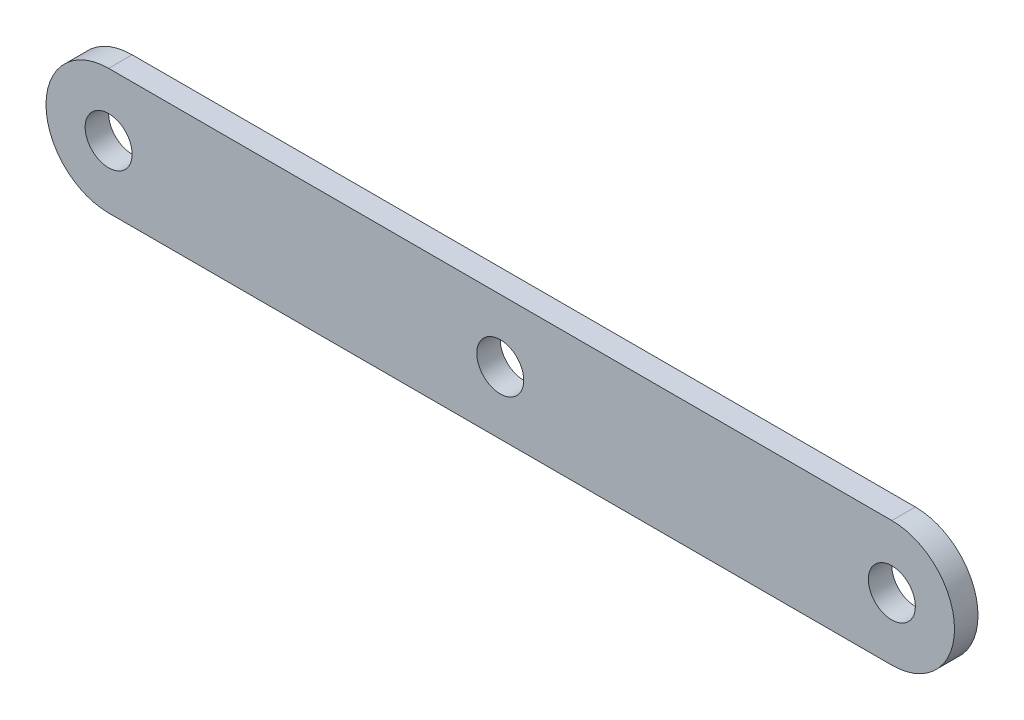
ISO-10303-21;
HEADER;
FILE_DESCRIPTION(('STEP AP214'),'2;1');
FILE_NAME('part.step','',(''),(''),'','','');
FILE_SCHEMA(('AUTOMOTIVE_DESIGN { 1 0 10303 214 1 1 1 1 }'));
ENDSEC;
DATA;
#1=APPLICATION_CONTEXT('core data for automotive mechanical design processes');
#2=APPLICATION_PROTOCOL_DEFINITION('international standard','automotive_design',2000,#1);
#3=PRODUCT_CONTEXT('',#1,'mechanical');
#4=PRODUCT('Part','Part','',(#3));
#5=PRODUCT_RELATED_PRODUCT_CATEGORY('part','',(#4));
#6=PRODUCT_DEFINITION_FORMATION('','',#4);
#7=PRODUCT_DEFINITION_CONTEXT('part definition',#1,'design');
#8=PRODUCT_DEFINITION('design','',#6,#7);
#9=PRODUCT_DEFINITION_SHAPE('','',#8);
#10=(LENGTH_UNIT() NAMED_UNIT(*) SI_UNIT(.MILLI.,.METRE.));
#11=(NAMED_UNIT(*) PLANE_ANGLE_UNIT() SI_UNIT($,.RADIAN.));
#12=(NAMED_UNIT(*) SI_UNIT($,.STERADIAN.) SOLID_ANGLE_UNIT());
#13=UNCERTAINTY_MEASURE_WITH_UNIT(LENGTH_MEASURE(1.E-05),#10,'distance_accuracy_value','');
#14=(GEOMETRIC_REPRESENTATION_CONTEXT(3) GLOBAL_UNCERTAINTY_ASSIGNED_CONTEXT((#13)) GLOBAL_UNIT_ASSIGNED_CONTEXT((#10,
#11,#12)) REPRESENTATION_CONTEXT('',''));
#15=CARTESIAN_POINT('',(0.,0.,0.));
#16=DIRECTION('',(0.,0.,1.));
#17=DIRECTION('',(1.,0.,0.));
#18=AXIS2_PLACEMENT_3D('',#15,#16,#17);
#19=CARTESIAN_POINT('',(-50.,0.,3.));
#20=DIRECTION('',(0.,0.,1.));
#21=DIRECTION('',(1.,0.,0.));
#22=AXIS2_PLACEMENT_3D('',#19,#20,#21);
#23=PLANE('',#22);
#24=CARTESIAN_POINT('',(50.,0.,3.));
#25=DIRECTION('',(0.,0.,1.));
#26=DIRECTION('',(1.,0.,0.));
#27=AXIS2_PLACEMENT_3D('',#24,#25,#26);
#28=CIRCLE('',#27,3.);
#29=CARTESIAN_POINT('',(53.,0.,3.));
#30=VERTEX_POINT('',#29);
#31=EDGE_CURVE('E115',#30,#30,#28,.T.);
#32=ORIENTED_EDGE('',*,*,#31,.F.);
#33=EDGE_LOOP('',(#32));
#34=FACE_BOUND('',#33,.T.);
#35=CARTESIAN_POINT('',(-50.,0.,3.));
#36=DIRECTION('',(0.,0.,1.));
#37=DIRECTION('',(1.,0.,0.));
#38=AXIS2_PLACEMENT_3D('',#35,#36,#37);
#39=CIRCLE('',#38,8.00000000000002);
#40=CARTESIAN_POINT('',(-50.,8.00000000000002,3.));
#41=VERTEX_POINT('',#40);
#42=CARTESIAN_POINT('',(-50.,-8.00000000000002,3.));
#43=VERTEX_POINT('',#42);
#44=EDGE_CURVE('E85',#41,#43,#39,.T.);
#45=ORIENTED_EDGE('',*,*,#44,.T.);
#46=DIRECTION('',(1.,0.,0.));
#47=VECTOR('',#46,1.);
#48=CARTESIAN_POINT('',(-50.,-8.00000000000002,3.));
#49=LINE('',#48,#47);
#50=CARTESIAN_POINT('',(50.,-8.,3.));
#51=VERTEX_POINT('',#50);
#52=EDGE_CURVE('E80',#43,#51,#49,.T.);
#53=ORIENTED_EDGE('',*,*,#52,.T.);
#54=CARTESIAN_POINT('',(50.,0.,3.));
#55=DIRECTION('',(0.,0.,1.));
#56=DIRECTION('',(1.,0.,0.));
#57=AXIS2_PLACEMENT_3D('',#54,#55,#56);
#58=CIRCLE('',#57,8.00000000000002);
#59=CARTESIAN_POINT('',(50.,8.00000000000004,3.));
#60=VERTEX_POINT('',#59);
#61=EDGE_CURVE('E83',#51,#60,#58,.T.);
#62=ORIENTED_EDGE('',*,*,#61,.T.);
#63=DIRECTION('',(-1.,0.,0.));
#64=VECTOR('',#63,1.);
#65=CARTESIAN_POINT('',(-50.,8.00000000000002,3.));
#66=LINE('',#65,#64);
#67=EDGE_CURVE('E50',#60,#41,#66,.T.);
#68=ORIENTED_EDGE('',*,*,#67,.T.);
#69=EDGE_LOOP('',(#45,#53,#62,#68));
#70=FACE_BOUND('',#69,.T.);
#71=CARTESIAN_POINT('',(-50.,0.,3.));
#72=DIRECTION('',(0.,0.,1.));
#73=DIRECTION('',(1.,0.,0.));
#74=AXIS2_PLACEMENT_3D('',#71,#72,#73);
#75=CIRCLE('',#74,2.99999999999999);
#76=CARTESIAN_POINT('',(-47.,0.,3.));
#77=VERTEX_POINT('',#76);
#78=EDGE_CURVE('E100',#77,#77,#75,.T.);
#79=ORIENTED_EDGE('',*,*,#78,.F.);
#80=EDGE_LOOP('',(#79));
#81=FACE_BOUND('',#80,.T.);
#82=CARTESIAN_POINT('',(0.,0.,3.));
#83=DIRECTION('',(0.,0.,1.));
#84=DIRECTION('',(1.,0.,0.));
#85=AXIS2_PLACEMENT_3D('',#82,#83,#84);
#86=CIRCLE('',#85,3.);
#87=CARTESIAN_POINT('',(3.,0.,3.));
#88=VERTEX_POINT('',#87);
#89=EDGE_CURVE('E121',#88,#88,#86,.T.);
#90=ORIENTED_EDGE('',*,*,#89,.F.);
#91=EDGE_LOOP('',(#90));
#92=FACE_BOUND('',#91,.T.);
#93=ADVANCED_FACE('F33',(#34,#70,#81,#92),#23,.T.);
#94=CARTESIAN_POINT('',(-50.,0.,0.));
#95=DIRECTION('',(0.,0.,1.));
#96=DIRECTION('',(1.,0.,0.));
#97=AXIS2_PLACEMENT_3D('',#94,#95,#96);
#98=PLANE('',#97);
#99=CARTESIAN_POINT('',(-50.,0.,0.));
#100=DIRECTION('',(0.,0.,1.));
#101=DIRECTION('',(1.,0.,0.));
#102=AXIS2_PLACEMENT_3D('',#99,#100,#101);
#103=CIRCLE('',#102,8.00000000000002);
#104=CARTESIAN_POINT('',(-50.,8.00000000000002,0.));
#105=VERTEX_POINT('',#104);
#106=CARTESIAN_POINT('',(-50.,-8.00000000000002,0.));
#107=VERTEX_POINT('',#106);
#108=EDGE_CURVE('E97',#105,#107,#103,.T.);
#109=ORIENTED_EDGE('',*,*,#108,.F.);
#110=DIRECTION('',(-1.,0.,0.));
#111=VECTOR('',#110,1.);
#112=CARTESIAN_POINT('',(-50.,8.00000000000002,0.));
#113=LINE('',#112,#111);
#114=CARTESIAN_POINT('',(50.,8.00000000000004,0.));
#115=VERTEX_POINT('',#114);
#116=EDGE_CURVE('E73',#115,#105,#113,.T.);
#117=ORIENTED_EDGE('',*,*,#116,.F.);
#118=CARTESIAN_POINT('',(50.,0.,0.));
#119=DIRECTION('',(0.,0.,1.));
#120=DIRECTION('',(1.,0.,0.));
#121=AXIS2_PLACEMENT_3D('',#118,#119,#120);
#122=CIRCLE('',#121,8.00000000000002);
#123=CARTESIAN_POINT('',(50.,-8.,0.));
#124=VERTEX_POINT('',#123);
#125=EDGE_CURVE('E67',#124,#115,#122,.T.);
#126=ORIENTED_EDGE('',*,*,#125,.F.);
#127=DIRECTION('',(1.,0.,0.));
#128=VECTOR('',#127,1.);
#129=CARTESIAN_POINT('',(-50.,-8.00000000000002,0.));
#130=LINE('',#129,#128);
#131=EDGE_CURVE('E89',#107,#124,#130,.T.);
#132=ORIENTED_EDGE('',*,*,#131,.F.);
#133=EDGE_LOOP('',(#109,#117,#126,#132));
#134=FACE_BOUND('',#133,.T.);
#135=CARTESIAN_POINT('',(-50.,0.,0.));
#136=DIRECTION('',(0.,0.,1.));
#137=DIRECTION('',(1.,0.,0.));
#138=AXIS2_PLACEMENT_3D('',#135,#136,#137);
#139=CIRCLE('',#138,2.99999999999999);
#140=CARTESIAN_POINT('',(-47.,0.,0.));
#141=VERTEX_POINT('',#140);
#142=EDGE_CURVE('E112',#141,#141,#139,.T.);
#143=ORIENTED_EDGE('',*,*,#142,.T.);
#144=EDGE_LOOP('',(#143));
#145=FACE_BOUND('',#144,.T.);
#146=CARTESIAN_POINT('',(50.,0.,0.));
#147=DIRECTION('',(0.,0.,1.));
#148=DIRECTION('',(1.,0.,0.));
#149=AXIS2_PLACEMENT_3D('',#146,#147,#148);
#150=CIRCLE('',#149,3.);
#151=CARTESIAN_POINT('',(53.,0.,0.));
#152=VERTEX_POINT('',#151);
#153=EDGE_CURVE('E118',#152,#152,#150,.T.);
#154=ORIENTED_EDGE('',*,*,#153,.T.);
#155=EDGE_LOOP('',(#154));
#156=FACE_BOUND('',#155,.T.);
#157=CARTESIAN_POINT('',(0.,0.,0.));
#158=DIRECTION('',(0.,0.,1.));
#159=DIRECTION('',(1.,0.,0.));
#160=AXIS2_PLACEMENT_3D('',#157,#158,#159);
#161=CIRCLE('',#160,3.);
#162=CARTESIAN_POINT('',(3.,0.,0.));
#163=VERTEX_POINT('',#162);
#164=EDGE_CURVE('E124',#163,#163,#161,.T.);
#165=ORIENTED_EDGE('',*,*,#164,.T.);
#166=EDGE_LOOP('',(#165));
#167=FACE_BOUND('',#166,.T.);
#168=ADVANCED_FACE('F108',(#134,#145,#156,#167),#98,.F.);
#169=CARTESIAN_POINT('',(-50.,0.,3.));
#170=DIRECTION('',(0.,0.,-1.));
#171=DIRECTION('',(-1.,0.,0.));
#172=AXIS2_PLACEMENT_3D('',#169,#170,#171);
#173=CYLINDRICAL_SURFACE('',#172,8.00000000000002);
#174=ORIENTED_EDGE('',*,*,#108,.T.);
#175=DIRECTION('',(0.,0.,-1.));
#176=VECTOR('',#175,1.);
#177=CARTESIAN_POINT('',(-50.,-8.00000000000002,3.));
#178=LINE('',#177,#176);
#179=EDGE_CURVE('E11',#43,#107,#178,.T.);
#180=ORIENTED_EDGE('',*,*,#179,.F.);
#181=ORIENTED_EDGE('',*,*,#44,.F.);
#182=DIRECTION('',(0.,0.,-1.));
#183=VECTOR('',#182,1.);
#184=CARTESIAN_POINT('',(-50.,8.00000000000002,3.));
#185=LINE('',#184,#183);
#186=EDGE_CURVE('E93',#41,#105,#185,.T.);
#187=ORIENTED_EDGE('',*,*,#186,.T.);
#188=EDGE_LOOP('',(#174,#180,#181,#187));
#189=FACE_BOUND('',#188,.T.);
#190=ADVANCED_FACE('F35',(#189),#173,.T.);
#191=CARTESIAN_POINT('',(-50.,-8.00000000000002,3.));
#192=DIRECTION('',(0.,1.,0.));
#193=DIRECTION('',(-1.,0.,0.));
#194=AXIS2_PLACEMENT_3D('',#191,#192,#193);
#195=PLANE('',#194);
#196=ORIENTED_EDGE('',*,*,#131,.T.);
#197=DIRECTION('',(0.,0.,-1.));
#198=VECTOR('',#197,1.);
#199=CARTESIAN_POINT('',(50.,-8.,3.));
#200=LINE('',#199,#198);
#201=EDGE_CURVE('E42',#51,#124,#200,.T.);
#202=ORIENTED_EDGE('',*,*,#201,.F.);
#203=ORIENTED_EDGE('',*,*,#52,.F.);
#204=ORIENTED_EDGE('',*,*,#179,.T.);
#205=EDGE_LOOP('',(#196,#202,#203,#204));
#206=FACE_BOUND('',#205,.T.);
#207=ADVANCED_FACE('F88',(#206),#195,.F.);
#208=CARTESIAN_POINT('',(50.,0.,3.));
#209=DIRECTION('',(0.,0.,-1.));
#210=DIRECTION('',(-1.,0.,0.));
#211=AXIS2_PLACEMENT_3D('',#208,#209,#210);
#212=CYLINDRICAL_SURFACE('',#211,8.00000000000002);
#213=ORIENTED_EDGE('',*,*,#125,.T.);
#214=DIRECTION('',(0.,0.,-1.));
#215=VECTOR('',#214,1.);
#216=CARTESIAN_POINT('',(50.,8.00000000000004,3.));
#217=LINE('',#216,#215);
#218=EDGE_CURVE('E90',#60,#115,#217,.T.);
#219=ORIENTED_EDGE('',*,*,#218,.F.);
#220=ORIENTED_EDGE('',*,*,#61,.F.);
#221=ORIENTED_EDGE('',*,*,#201,.T.);
#222=EDGE_LOOP('',(#213,#219,#220,#221));
#223=FACE_BOUND('',#222,.T.);
#224=ADVANCED_FACE('F91',(#223),#212,.T.);
#225=CARTESIAN_POINT('',(-50.,8.00000000000002,3.));
#226=DIRECTION('',(0.,-1.,0.));
#227=DIRECTION('',(1.,0.,0.));
#228=AXIS2_PLACEMENT_3D('',#225,#226,#227);
#229=PLANE('',#228);
#230=ORIENTED_EDGE('',*,*,#116,.T.);
#231=ORIENTED_EDGE('',*,*,#186,.F.);
#232=ORIENTED_EDGE('',*,*,#67,.F.);
#233=ORIENTED_EDGE('',*,*,#218,.T.);
#234=EDGE_LOOP('',(#230,#231,#232,#233));
#235=FACE_BOUND('',#234,.T.);
#236=ADVANCED_FACE('F105',(#235),#229,.F.);
#237=CARTESIAN_POINT('',(-50.,0.,3.));
#238=DIRECTION('',(0.,0.,-1.));
#239=DIRECTION('',(-1.,0.,0.));
#240=AXIS2_PLACEMENT_3D('',#237,#238,#239);
#241=CYLINDRICAL_SURFACE('',#240,2.99999999999999);
#242=ORIENTED_EDGE('',*,*,#78,.T.);
#243=EDGE_LOOP('',(#242));
#244=FACE_BOUND('',#243,.T.);
#245=ORIENTED_EDGE('',*,*,#142,.F.);
#246=EDGE_LOOP('',(#245));
#247=FACE_BOUND('',#246,.T.);
#248=ADVANCED_FACE('F142',(#244,#247),#241,.F.);
#249=CARTESIAN_POINT('',(50.,0.,3.));
#250=DIRECTION('',(0.,0.,-1.));
#251=DIRECTION('',(-1.,0.,0.));
#252=AXIS2_PLACEMENT_3D('',#249,#250,#251);
#253=CYLINDRICAL_SURFACE('',#252,3.);
#254=ORIENTED_EDGE('',*,*,#31,.T.);
#255=EDGE_LOOP('',(#254));
#256=FACE_BOUND('',#255,.T.);
#257=ORIENTED_EDGE('',*,*,#153,.F.);
#258=EDGE_LOOP('',(#257));
#259=FACE_BOUND('',#258,.T.);
#260=ADVANCED_FACE('F188',(#256,#259),#253,.F.);
#261=CARTESIAN_POINT('',(0.,0.,3.));
#262=DIRECTION('',(0.,0.,-1.));
#263=DIRECTION('',(-1.,0.,0.));
#264=AXIS2_PLACEMENT_3D('',#261,#262,#263);
#265=CYLINDRICAL_SURFACE('',#264,3.);
#266=ORIENTED_EDGE('',*,*,#89,.T.);
#267=EDGE_LOOP('',(#266));
#268=FACE_BOUND('',#267,.T.);
#269=ORIENTED_EDGE('',*,*,#164,.F.);
#270=EDGE_LOOP('',(#269));
#271=FACE_BOUND('',#270,.T.);
#272=ADVANCED_FACE('F130',(#268,#271),#265,.F.);
#273=CLOSED_SHELL('',(#93,#168,#190,#207,#224,#236,#248,#260,#272));
#274=MANIFOLD_SOLID_BREP('B2',#273);
#275=ADVANCED_BREP_SHAPE_REPRESENTATION('',(#18,#274),#14);
#276=SHAPE_DEFINITION_REPRESENTATION(#9,#275);
ENDSEC;
END-ISO-10303-21;
